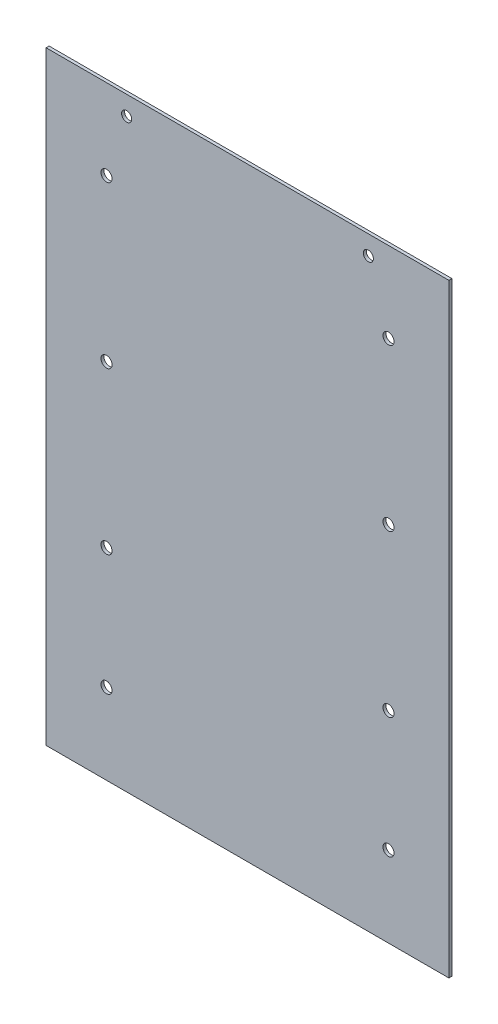
ISO-10303-21;
HEADER;
FILE_DESCRIPTION(('STEP AP214'),'2;1');
FILE_NAME('part.step','',(''),(''),'','','');
FILE_SCHEMA(('AUTOMOTIVE_DESIGN { 1 0 10303 214 1 1 1 1 }'));
ENDSEC;
DATA;
#1=APPLICATION_CONTEXT('core data for automotive mechanical design processes');
#2=APPLICATION_PROTOCOL_DEFINITION('international standard','automotive_design',2000,#1);
#3=PRODUCT_CONTEXT('',#1,'mechanical');
#4=PRODUCT('Part','Part','',(#3));
#5=PRODUCT_RELATED_PRODUCT_CATEGORY('part','',(#4));
#6=PRODUCT_DEFINITION_FORMATION('','',#4);
#7=PRODUCT_DEFINITION_CONTEXT('part definition',#1,'design');
#8=PRODUCT_DEFINITION('design','',#6,#7);
#9=PRODUCT_DEFINITION_SHAPE('','',#8);
#10=(LENGTH_UNIT() NAMED_UNIT(*) SI_UNIT(.MILLI.,.METRE.));
#11=(NAMED_UNIT(*) PLANE_ANGLE_UNIT() SI_UNIT($,.RADIAN.));
#12=(NAMED_UNIT(*) SI_UNIT($,.STERADIAN.) SOLID_ANGLE_UNIT());
#13=UNCERTAINTY_MEASURE_WITH_UNIT(LENGTH_MEASURE(1.E-05),#10,'distance_accuracy_value','');
#14=(GEOMETRIC_REPRESENTATION_CONTEXT(3) GLOBAL_UNCERTAINTY_ASSIGNED_CONTEXT((#13)) GLOBAL_UNIT_ASSIGNED_CONTEXT((#10,
#11,#12)) REPRESENTATION_CONTEXT('',''));
#15=CARTESIAN_POINT('',(0.,0.,0.));
#16=DIRECTION('',(0.,0.,1.));
#17=DIRECTION('',(1.,0.,0.));
#18=AXIS2_PLACEMENT_3D('',#15,#16,#17);
#19=CARTESIAN_POINT('',(170.,100.,-1.5));
#20=DIRECTION('',(0.,0.,1.));
#21=DIRECTION('',(1.,0.,0.));
#22=AXIS2_PLACEMENT_3D('',#19,#20,#21);
#23=CYLINDRICAL_SURFACE('',#22,2.75000000000001);
#24=CARTESIAN_POINT('',(170.,100.,-1.5));
#25=DIRECTION('',(0.,0.,1.));
#26=DIRECTION('',(1.,0.,0.));
#27=AXIS2_PLACEMENT_3D('',#24,#25,#26);
#28=CIRCLE('',#27,2.75000000000001);
#29=CARTESIAN_POINT('',(172.75,100.,-1.5));
#30=VERTEX_POINT('',#29);
#31=EDGE_CURVE('E56',#30,#30,#28,.T.);
#32=ORIENTED_EDGE('',*,*,#31,.F.);
#33=EDGE_LOOP('',(#32));
#34=FACE_BOUND('',#33,.T.);
#35=CARTESIAN_POINT('',(170.,100.,0.));
#36=DIRECTION('',(0.,0.,1.));
#37=DIRECTION('',(1.,0.,0.));
#38=AXIS2_PLACEMENT_3D('',#35,#36,#37);
#39=CIRCLE('',#38,2.75000000000001);
#40=CARTESIAN_POINT('',(172.75,100.,0.));
#41=VERTEX_POINT('',#40);
#42=EDGE_CURVE('E11',#41,#41,#39,.T.);
#43=ORIENTED_EDGE('',*,*,#42,.T.);
#44=EDGE_LOOP('',(#43));
#45=FACE_BOUND('',#44,.T.);
#46=ADVANCED_FACE('F48',(#34,#45),#23,.F.);
#47=CARTESIAN_POINT('',(30.,100.,-1.5));
#48=DIRECTION('',(0.,0.,1.));
#49=DIRECTION('',(1.,0.,0.));
#50=AXIS2_PLACEMENT_3D('',#47,#48,#49);
#51=CYLINDRICAL_SURFACE('',#50,2.75);
#52=CARTESIAN_POINT('',(30.,100.,-1.5));
#53=DIRECTION('',(0.,0.,1.));
#54=DIRECTION('',(1.,0.,0.));
#55=AXIS2_PLACEMENT_3D('',#52,#53,#54);
#56=CIRCLE('',#55,2.75);
#57=CARTESIAN_POINT('',(32.75,100.,-1.5));
#58=VERTEX_POINT('',#57);
#59=EDGE_CURVE('E127',#58,#58,#56,.T.);
#60=ORIENTED_EDGE('',*,*,#59,.F.);
#61=EDGE_LOOP('',(#60));
#62=FACE_BOUND('',#61,.T.);
#63=CARTESIAN_POINT('',(30.,100.,0.));
#64=DIRECTION('',(0.,0.,1.));
#65=DIRECTION('',(1.,0.,0.));
#66=AXIS2_PLACEMENT_3D('',#63,#64,#65);
#67=CIRCLE('',#66,2.75);
#68=CARTESIAN_POINT('',(32.75,100.,0.));
#69=VERTEX_POINT('',#68);
#70=EDGE_CURVE('E132',#69,#69,#67,.T.);
#71=ORIENTED_EDGE('',*,*,#70,.T.);
#72=EDGE_LOOP('',(#71));
#73=FACE_BOUND('',#72,.T.);
#74=ADVANCED_FACE('F140',(#62,#73),#51,.F.);
#75=CARTESIAN_POINT('',(0.,0.,-1.5));
#76=DIRECTION('',(-1.,0.,0.));
#77=DIRECTION('',(0.,0.,1.));
#78=AXIS2_PLACEMENT_3D('',#75,#76,#77);
#79=PLANE('',#78);
#80=DIRECTION('',(0.,-1.,0.));
#81=VECTOR('',#80,1.);
#82=CARTESIAN_POINT('',(0.,0.,0.));
#83=LINE('',#82,#81);
#84=CARTESIAN_POINT('',(0.,300.,0.));
#85=VERTEX_POINT('',#84);
#86=CARTESIAN_POINT('',(0.,0.,0.));
#87=VERTEX_POINT('',#86);
#88=EDGE_CURVE('E117',#85,#87,#83,.T.);
#89=ORIENTED_EDGE('',*,*,#88,.F.);
#90=DIRECTION('',(0.,0.,1.));
#91=VECTOR('',#90,1.);
#92=CARTESIAN_POINT('',(0.,300.,-1.5));
#93=LINE('',#92,#91);
#94=CARTESIAN_POINT('',(0.,300.,-1.5));
#95=VERTEX_POINT('',#94);
#96=EDGE_CURVE('E64',#95,#85,#93,.T.);
#97=ORIENTED_EDGE('',*,*,#96,.F.);
#98=DIRECTION('',(0.,-1.,0.));
#99=VECTOR('',#98,1.);
#100=CARTESIAN_POINT('',(0.,0.,-1.5));
#101=LINE('',#100,#99);
#102=CARTESIAN_POINT('',(0.,0.,-1.5));
#103=VERTEX_POINT('',#102);
#104=EDGE_CURVE('E110',#95,#103,#101,.T.);
#105=ORIENTED_EDGE('',*,*,#104,.T.);
#106=DIRECTION('',(0.,0.,1.));
#107=VECTOR('',#106,1.);
#108=CARTESIAN_POINT('',(0.,0.,-1.5));
#109=LINE('',#108,#107);
#110=EDGE_CURVE('E92',#103,#87,#109,.T.);
#111=ORIENTED_EDGE('',*,*,#110,.T.);
#112=EDGE_LOOP('',(#89,#97,#105,#111));
#113=FACE_BOUND('',#112,.T.);
#114=ADVANCED_FACE('F163',(#113),#79,.T.);
#115=CARTESIAN_POINT('',(0.,300.,-1.5));
#116=DIRECTION('',(0.,1.,0.));
#117=DIRECTION('',(-1.,0.,0.));
#118=AXIS2_PLACEMENT_3D('',#115,#116,#117);
#119=PLANE('',#118);
#120=DIRECTION('',(-1.,0.,0.));
#121=VECTOR('',#120,1.);
#122=CARTESIAN_POINT('',(0.,300.,0.));
#123=LINE('',#122,#121);
#124=CARTESIAN_POINT('',(200.,300.,0.));
#125=VERTEX_POINT('',#124);
#126=EDGE_CURVE('E112',#125,#85,#123,.T.);
#127=ORIENTED_EDGE('',*,*,#126,.F.);
#128=DIRECTION('',(0.,0.,1.));
#129=VECTOR('',#128,1.);
#130=CARTESIAN_POINT('',(200.,300.,-1.5));
#131=LINE('',#130,#129);
#132=CARTESIAN_POINT('',(200.,300.,-1.5));
#133=VERTEX_POINT('',#132);
#134=EDGE_CURVE('E81',#133,#125,#131,.T.);
#135=ORIENTED_EDGE('',*,*,#134,.F.);
#136=DIRECTION('',(-1.,0.,0.));
#137=VECTOR('',#136,1.);
#138=CARTESIAN_POINT('',(0.,300.,-1.5));
#139=LINE('',#138,#137);
#140=EDGE_CURVE('E107',#133,#95,#139,.T.);
#141=ORIENTED_EDGE('',*,*,#140,.T.);
#142=ORIENTED_EDGE('',*,*,#96,.T.);
#143=EDGE_LOOP('',(#127,#135,#141,#142));
#144=FACE_BOUND('',#143,.T.);
#145=ADVANCED_FACE('F160',(#144),#119,.T.);
#146=CARTESIAN_POINT('',(200.,0.,-1.5));
#147=DIRECTION('',(1.,0.,0.));
#148=DIRECTION('',(0.,0.,-1.));
#149=AXIS2_PLACEMENT_3D('',#146,#147,#148);
#150=PLANE('',#149);
#151=DIRECTION('',(0.,1.,0.));
#152=VECTOR('',#151,1.);
#153=CARTESIAN_POINT('',(200.,0.,0.));
#154=LINE('',#153,#152);
#155=CARTESIAN_POINT('',(200.,0.,0.));
#156=VERTEX_POINT('',#155);
#157=EDGE_CURVE('E100',#156,#125,#154,.T.);
#158=ORIENTED_EDGE('',*,*,#157,.F.);
#159=DIRECTION('',(0.,0.,1.));
#160=VECTOR('',#159,1.);
#161=CARTESIAN_POINT('',(200.,0.,-1.5));
#162=LINE('',#161,#160);
#163=CARTESIAN_POINT('',(200.,0.,-1.5));
#164=VERTEX_POINT('',#163);
#165=EDGE_CURVE('E95',#164,#156,#162,.T.);
#166=ORIENTED_EDGE('',*,*,#165,.F.);
#167=DIRECTION('',(0.,1.,0.));
#168=VECTOR('',#167,1.);
#169=CARTESIAN_POINT('',(200.,0.,-1.5));
#170=LINE('',#169,#168);
#171=EDGE_CURVE('E98',#164,#133,#170,.T.);
#172=ORIENTED_EDGE('',*,*,#171,.T.);
#173=ORIENTED_EDGE('',*,*,#134,.T.);
#174=EDGE_LOOP('',(#158,#166,#172,#173));
#175=FACE_BOUND('',#174,.T.);
#176=ADVANCED_FACE('F97',(#175),#150,.T.);
#177=CARTESIAN_POINT('',(0.,0.,-1.5));
#178=DIRECTION('',(0.,-1.,0.));
#179=DIRECTION('',(0.,0.,-1.));
#180=AXIS2_PLACEMENT_3D('',#177,#178,#179);
#181=PLANE('',#180);
#182=DIRECTION('',(1.,0.,0.));
#183=VECTOR('',#182,1.);
#184=CARTESIAN_POINT('',(0.,0.,0.));
#185=LINE('',#184,#183);
#186=EDGE_CURVE('E120',#87,#156,#185,.T.);
#187=ORIENTED_EDGE('',*,*,#186,.F.);
#188=ORIENTED_EDGE('',*,*,#110,.F.);
#189=DIRECTION('',(1.,0.,0.));
#190=VECTOR('',#189,1.);
#191=CARTESIAN_POINT('',(0.,0.,-1.5));
#192=LINE('',#191,#190);
#193=EDGE_CURVE('E106',#103,#164,#192,.T.);
#194=ORIENTED_EDGE('',*,*,#193,.T.);
#195=ORIENTED_EDGE('',*,*,#165,.T.);
#196=EDGE_LOOP('',(#187,#188,#194,#195));
#197=FACE_BOUND('',#196,.T.);
#198=ADVANCED_FACE('F109',(#197),#181,.T.);
#199=CARTESIAN_POINT('',(0.,0.,-1.5));
#200=DIRECTION('',(0.,0.,-1.));
#201=DIRECTION('',(-1.,0.,0.));
#202=AXIS2_PLACEMENT_3D('',#199,#200,#201);
#203=PLANE('',#202);
#204=CARTESIAN_POINT('',(30.,40.0000000000001,-1.5));
#205=DIRECTION('',(0.,0.,1.));
#206=DIRECTION('',(1.,0.,0.));
#207=AXIS2_PLACEMENT_3D('',#204,#205,#206);
#208=CIRCLE('',#207,2.75);
#209=CARTESIAN_POINT('',(32.75,40.0000000000001,-1.5));
#210=VERTEX_POINT('',#209);
#211=EDGE_CURVE('E378',#210,#210,#208,.T.);
#212=ORIENTED_EDGE('',*,*,#211,.T.);
#213=EDGE_LOOP('',(#212));
#214=FACE_BOUND('',#213,.T.);
#215=CARTESIAN_POINT('',(170.,40.0000000000001,-1.5));
#216=DIRECTION('',(0.,0.,1.));
#217=DIRECTION('',(1.,0.,0.));
#218=AXIS2_PLACEMENT_3D('',#215,#216,#217);
#219=CIRCLE('',#218,2.75000000000001);
#220=CARTESIAN_POINT('',(172.75,40.0000000000001,-1.5));
#221=VERTEX_POINT('',#220);
#222=EDGE_CURVE('E382',#221,#221,#219,.T.);
#223=ORIENTED_EDGE('',*,*,#222,.T.);
#224=EDGE_LOOP('',(#223));
#225=FACE_BOUND('',#224,.T.);
#226=CARTESIAN_POINT('',(170.,180.,-1.5));
#227=DIRECTION('',(0.,0.,1.));
#228=DIRECTION('',(1.,0.,0.));
#229=AXIS2_PLACEMENT_3D('',#226,#227,#228);
#230=CIRCLE('',#229,2.75000000000001);
#231=CARTESIAN_POINT('',(172.75,180.,-1.5));
#232=VERTEX_POINT('',#231);
#233=EDGE_CURVE('E373',#232,#232,#230,.T.);
#234=ORIENTED_EDGE('',*,*,#233,.T.);
#235=EDGE_LOOP('',(#234));
#236=FACE_BOUND('',#235,.T.);
#237=CARTESIAN_POINT('',(30.,180.,-1.5));
#238=DIRECTION('',(0.,0.,1.));
#239=DIRECTION('',(1.,0.,0.));
#240=AXIS2_PLACEMENT_3D('',#237,#238,#239);
#241=CIRCLE('',#240,2.75);
#242=CARTESIAN_POINT('',(32.75,180.,-1.5));
#243=VERTEX_POINT('',#242);
#244=EDGE_CURVE('E365',#243,#243,#241,.T.);
#245=ORIENTED_EDGE('',*,*,#244,.T.);
#246=EDGE_LOOP('',(#245));
#247=FACE_BOUND('',#246,.T.);
#248=CARTESIAN_POINT('',(30.,260.,-1.5));
#249=DIRECTION('',(0.,0.,1.));
#250=DIRECTION('',(1.,0.,0.));
#251=AXIS2_PLACEMENT_3D('',#248,#249,#250);
#252=CIRCLE('',#251,2.75);
#253=CARTESIAN_POINT('',(32.75,260.,-1.5));
#254=VERTEX_POINT('',#253);
#255=EDGE_CURVE('E344',#254,#254,#252,.T.);
#256=ORIENTED_EDGE('',*,*,#255,.T.);
#257=EDGE_LOOP('',(#256));
#258=FACE_BOUND('',#257,.T.);
#259=CARTESIAN_POINT('',(170.,260.,-1.5));
#260=DIRECTION('',(0.,0.,1.));
#261=DIRECTION('',(1.,0.,0.));
#262=AXIS2_PLACEMENT_3D('',#259,#260,#261);
#263=CIRCLE('',#262,2.75000000000001);
#264=CARTESIAN_POINT('',(172.75,260.,-1.5));
#265=VERTEX_POINT('',#264);
#266=EDGE_CURVE('E353',#265,#265,#263,.T.);
#267=ORIENTED_EDGE('',*,*,#266,.T.);
#268=EDGE_LOOP('',(#267));
#269=FACE_BOUND('',#268,.T.);
#270=CARTESIAN_POINT('',(40.,290.5,-1.5));
#271=DIRECTION('',(0.,0.,1.));
#272=DIRECTION('',(1.,0.,0.));
#273=AXIS2_PLACEMENT_3D('',#270,#271,#272);
#274=CIRCLE('',#273,2.5);
#275=CARTESIAN_POINT('',(42.5,290.5,-1.5));
#276=VERTEX_POINT('',#275);
#277=EDGE_CURVE('E121',#276,#276,#274,.T.);
#278=ORIENTED_EDGE('',*,*,#277,.T.);
#279=EDGE_LOOP('',(#278));
#280=FACE_BOUND('',#279,.T.);
#281=CARTESIAN_POINT('',(160.,290.5,-1.5));
#282=DIRECTION('',(0.,0.,1.));
#283=DIRECTION('',(1.,0.,0.));
#284=AXIS2_PLACEMENT_3D('',#281,#282,#283);
#285=CIRCLE('',#284,2.5);
#286=CARTESIAN_POINT('',(162.5,290.5,-1.5));
#287=VERTEX_POINT('',#286);
#288=EDGE_CURVE('E336',#287,#287,#285,.T.);
#289=ORIENTED_EDGE('',*,*,#288,.T.);
#290=EDGE_LOOP('',(#289));
#291=FACE_BOUND('',#290,.T.);
#292=ORIENTED_EDGE('',*,*,#104,.F.);
#293=ORIENTED_EDGE('',*,*,#140,.F.);
#294=ORIENTED_EDGE('',*,*,#171,.F.);
#295=ORIENTED_EDGE('',*,*,#193,.F.);
#296=EDGE_LOOP('',(#292,#293,#294,#295));
#297=FACE_BOUND('',#296,.T.);
#298=ORIENTED_EDGE('',*,*,#59,.T.);
#299=EDGE_LOOP('',(#298));
#300=FACE_BOUND('',#299,.T.);
#301=ORIENTED_EDGE('',*,*,#31,.T.);
#302=EDGE_LOOP('',(#301));
#303=FACE_BOUND('',#302,.T.);
#304=ADVANCED_FACE('F104',(#214,#225,#236,#247,#258,#269,#280,#291,#297,#300,#303),#203,.T.);
#305=CARTESIAN_POINT('',(0.,0.,0.));
#306=DIRECTION('',(0.,0.,-1.));
#307=DIRECTION('',(-1.,0.,0.));
#308=AXIS2_PLACEMENT_3D('',#305,#306,#307);
#309=PLANE('',#308);
#310=CARTESIAN_POINT('',(30.,40.0000000000001,0.));
#311=DIRECTION('',(0.,0.,1.));
#312=DIRECTION('',(1.,0.,0.));
#313=AXIS2_PLACEMENT_3D('',#310,#311,#312);
#314=CIRCLE('',#313,2.75);
#315=CARTESIAN_POINT('',(32.75,40.0000000000001,0.));
#316=VERTEX_POINT('',#315);
#317=EDGE_CURVE('E385',#316,#316,#314,.T.);
#318=ORIENTED_EDGE('',*,*,#317,.F.);
#319=EDGE_LOOP('',(#318));
#320=FACE_BOUND('',#319,.T.);
#321=CARTESIAN_POINT('',(170.,40.0000000000001,0.));
#322=DIRECTION('',(0.,0.,1.));
#323=DIRECTION('',(1.,0.,0.));
#324=AXIS2_PLACEMENT_3D('',#321,#322,#323);
#325=CIRCLE('',#324,2.75000000000001);
#326=CARTESIAN_POINT('',(172.75,40.0000000000001,0.));
#327=VERTEX_POINT('',#326);
#328=EDGE_CURVE('E379',#327,#327,#325,.T.);
#329=ORIENTED_EDGE('',*,*,#328,.F.);
#330=EDGE_LOOP('',(#329));
#331=FACE_BOUND('',#330,.T.);
#332=CARTESIAN_POINT('',(170.,180.,0.));
#333=DIRECTION('',(0.,0.,1.));
#334=DIRECTION('',(1.,0.,0.));
#335=AXIS2_PLACEMENT_3D('',#332,#333,#334);
#336=CIRCLE('',#335,2.75000000000001);
#337=CARTESIAN_POINT('',(172.75,180.,0.));
#338=VERTEX_POINT('',#337);
#339=EDGE_CURVE('E369',#338,#338,#336,.T.);
#340=ORIENTED_EDGE('',*,*,#339,.F.);
#341=EDGE_LOOP('',(#340));
#342=FACE_BOUND('',#341,.T.);
#343=CARTESIAN_POINT('',(30.,180.,0.));
#344=DIRECTION('',(0.,0.,1.));
#345=DIRECTION('',(1.,0.,0.));
#346=AXIS2_PLACEMENT_3D('',#343,#344,#345);
#347=CIRCLE('',#346,2.75);
#348=CARTESIAN_POINT('',(32.75,180.,0.));
#349=VERTEX_POINT('',#348);
#350=EDGE_CURVE('E356',#349,#349,#347,.T.);
#351=ORIENTED_EDGE('',*,*,#350,.F.);
#352=EDGE_LOOP('',(#351));
#353=FACE_BOUND('',#352,.T.);
#354=CARTESIAN_POINT('',(30.,260.,0.));
#355=DIRECTION('',(0.,0.,1.));
#356=DIRECTION('',(1.,0.,0.));
#357=AXIS2_PLACEMENT_3D('',#354,#355,#356);
#358=CIRCLE('',#357,2.75);
#359=CARTESIAN_POINT('',(32.75,260.,0.));
#360=VERTEX_POINT('',#359);
#361=EDGE_CURVE('E348',#360,#360,#358,.T.);
#362=ORIENTED_EDGE('',*,*,#361,.F.);
#363=EDGE_LOOP('',(#362));
#364=FACE_BOUND('',#363,.T.);
#365=CARTESIAN_POINT('',(170.,260.,0.));
#366=DIRECTION('',(0.,0.,1.));
#367=DIRECTION('',(1.,0.,0.));
#368=AXIS2_PLACEMENT_3D('',#365,#366,#367);
#369=CIRCLE('',#368,2.75000000000001);
#370=CARTESIAN_POINT('',(172.75,260.,0.));
#371=VERTEX_POINT('',#370);
#372=EDGE_CURVE('E360',#371,#371,#369,.T.);
#373=ORIENTED_EDGE('',*,*,#372,.F.);
#374=EDGE_LOOP('',(#373));
#375=FACE_BOUND('',#374,.T.);
#376=CARTESIAN_POINT('',(40.,290.5,0.));
#377=DIRECTION('',(0.,0.,1.));
#378=DIRECTION('',(1.,0.,0.));
#379=AXIS2_PLACEMENT_3D('',#376,#377,#378);
#380=CIRCLE('',#379,2.5);
#381=CARTESIAN_POINT('',(42.5,290.5,0.));
#382=VERTEX_POINT('',#381);
#383=EDGE_CURVE('E334',#382,#382,#380,.T.);
#384=ORIENTED_EDGE('',*,*,#383,.F.);
#385=EDGE_LOOP('',(#384));
#386=FACE_BOUND('',#385,.T.);
#387=CARTESIAN_POINT('',(160.,290.5,0.));
#388=DIRECTION('',(0.,0.,1.));
#389=DIRECTION('',(1.,0.,0.));
#390=AXIS2_PLACEMENT_3D('',#387,#388,#389);
#391=CIRCLE('',#390,2.5);
#392=CARTESIAN_POINT('',(162.5,290.5,0.));
#393=VERTEX_POINT('',#392);
#394=EDGE_CURVE('E340',#393,#393,#391,.T.);
#395=ORIENTED_EDGE('',*,*,#394,.F.);
#396=EDGE_LOOP('',(#395));
#397=FACE_BOUND('',#396,.T.);
#398=ORIENTED_EDGE('',*,*,#88,.T.);
#399=ORIENTED_EDGE('',*,*,#186,.T.);
#400=ORIENTED_EDGE('',*,*,#157,.T.);
#401=ORIENTED_EDGE('',*,*,#126,.T.);
#402=EDGE_LOOP('',(#398,#399,#400,#401));
#403=FACE_BOUND('',#402,.T.);
#404=ORIENTED_EDGE('',*,*,#70,.F.);
#405=EDGE_LOOP('',(#404));
#406=FACE_BOUND('',#405,.T.);
#407=ORIENTED_EDGE('',*,*,#42,.F.);
#408=EDGE_LOOP('',(#407));
#409=FACE_BOUND('',#408,.T.);
#410=ADVANCED_FACE('F143',(#320,#331,#342,#353,#364,#375,#386,#397,#403,#406,#409),#309,.F.);
#411=CARTESIAN_POINT('',(160.,290.5,-1.5));
#412=DIRECTION('',(0.,0.,1.));
#413=DIRECTION('',(1.,0.,0.));
#414=AXIS2_PLACEMENT_3D('',#411,#412,#413);
#415=CYLINDRICAL_SURFACE('',#414,2.5);
#416=ORIENTED_EDGE('',*,*,#288,.F.);
#417=EDGE_LOOP('',(#416));
#418=FACE_BOUND('',#417,.T.);
#419=ORIENTED_EDGE('',*,*,#394,.T.);
#420=EDGE_LOOP('',(#419));
#421=FACE_BOUND('',#420,.T.);
#422=ADVANCED_FACE('F145',(#418,#421),#415,.F.);
#423=CARTESIAN_POINT('',(40.,290.5,-1.5));
#424=DIRECTION('',(0.,0.,1.));
#425=DIRECTION('',(1.,0.,0.));
#426=AXIS2_PLACEMENT_3D('',#423,#424,#425);
#427=CYLINDRICAL_SURFACE('',#426,2.5);
#428=ORIENTED_EDGE('',*,*,#277,.F.);
#429=EDGE_LOOP('',(#428));
#430=FACE_BOUND('',#429,.T.);
#431=ORIENTED_EDGE('',*,*,#383,.T.);
#432=EDGE_LOOP('',(#431));
#433=FACE_BOUND('',#432,.T.);
#434=ADVANCED_FACE('F152',(#430,#433),#427,.F.);
#435=CARTESIAN_POINT('',(170.,260.,-1.5));
#436=DIRECTION('',(0.,0.,1.));
#437=DIRECTION('',(1.,0.,0.));
#438=AXIS2_PLACEMENT_3D('',#435,#436,#437);
#439=CYLINDRICAL_SURFACE('',#438,2.75000000000001);
#440=ORIENTED_EDGE('',*,*,#266,.F.);
#441=EDGE_LOOP('',(#440));
#442=FACE_BOUND('',#441,.T.);
#443=ORIENTED_EDGE('',*,*,#372,.T.);
#444=EDGE_LOOP('',(#443));
#445=FACE_BOUND('',#444,.T.);
#446=ADVANCED_FACE('F268',(#442,#445),#439,.F.);
#447=CARTESIAN_POINT('',(30.,260.,-1.5));
#448=DIRECTION('',(0.,0.,1.));
#449=DIRECTION('',(1.,0.,0.));
#450=AXIS2_PLACEMENT_3D('',#447,#448,#449);
#451=CYLINDRICAL_SURFACE('',#450,2.75);
#452=ORIENTED_EDGE('',*,*,#255,.F.);
#453=EDGE_LOOP('',(#452));
#454=FACE_BOUND('',#453,.T.);
#455=ORIENTED_EDGE('',*,*,#361,.T.);
#456=EDGE_LOOP('',(#455));
#457=FACE_BOUND('',#456,.T.);
#458=ADVANCED_FACE('F260',(#454,#457),#451,.F.);
#459=CARTESIAN_POINT('',(30.,180.,-1.5));
#460=DIRECTION('',(0.,0.,1.));
#461=DIRECTION('',(1.,0.,0.));
#462=AXIS2_PLACEMENT_3D('',#459,#460,#461);
#463=CYLINDRICAL_SURFACE('',#462,2.75);
#464=ORIENTED_EDGE('',*,*,#244,.F.);
#465=EDGE_LOOP('',(#464));
#466=FACE_BOUND('',#465,.T.);
#467=ORIENTED_EDGE('',*,*,#350,.T.);
#468=EDGE_LOOP('',(#467));
#469=FACE_BOUND('',#468,.T.);
#470=ADVANCED_FACE('F247',(#466,#469),#463,.F.);
#471=CARTESIAN_POINT('',(170.,180.,-1.5));
#472=DIRECTION('',(0.,0.,1.));
#473=DIRECTION('',(1.,0.,0.));
#474=AXIS2_PLACEMENT_3D('',#471,#472,#473);
#475=CYLINDRICAL_SURFACE('',#474,2.75000000000001);
#476=ORIENTED_EDGE('',*,*,#233,.F.);
#477=EDGE_LOOP('',(#476));
#478=FACE_BOUND('',#477,.T.);
#479=ORIENTED_EDGE('',*,*,#339,.T.);
#480=EDGE_LOOP('',(#479));
#481=FACE_BOUND('',#480,.T.);
#482=ADVANCED_FACE('F208',(#478,#481),#475,.F.);
#483=CARTESIAN_POINT('',(170.,40.0000000000001,-1.5));
#484=DIRECTION('',(0.,0.,1.));
#485=DIRECTION('',(1.,0.,0.));
#486=AXIS2_PLACEMENT_3D('',#483,#484,#485);
#487=CYLINDRICAL_SURFACE('',#486,2.75000000000001);
#488=ORIENTED_EDGE('',*,*,#222,.F.);
#489=EDGE_LOOP('',(#488));
#490=FACE_BOUND('',#489,.T.);
#491=ORIENTED_EDGE('',*,*,#328,.T.);
#492=EDGE_LOOP('',(#491));
#493=FACE_BOUND('',#492,.T.);
#494=ADVANCED_FACE('F215',(#490,#493),#487,.F.);
#495=CARTESIAN_POINT('',(30.,40.0000000000001,-1.5));
#496=DIRECTION('',(0.,0.,1.));
#497=DIRECTION('',(1.,0.,0.));
#498=AXIS2_PLACEMENT_3D('',#495,#496,#497);
#499=CYLINDRICAL_SURFACE('',#498,2.75);
#500=ORIENTED_EDGE('',*,*,#211,.F.);
#501=EDGE_LOOP('',(#500));
#502=FACE_BOUND('',#501,.T.);
#503=ORIENTED_EDGE('',*,*,#317,.T.);
#504=EDGE_LOOP('',(#503));
#505=FACE_BOUND('',#504,.T.);
#506=ADVANCED_FACE('F220',(#502,#505),#499,.F.);
#507=CLOSED_SHELL('',(#46,#74,#114,#145,#176,#198,#304,#410,#422,#434,#446,#458,#470,#482,#494,#506));
#508=MANIFOLD_SOLID_BREP('B2',#507);
#509=ADVANCED_BREP_SHAPE_REPRESENTATION('',(#18,#508),#14);
#510=SHAPE_DEFINITION_REPRESENTATION(#9,#509);
ENDSEC;
END-ISO-10303-21;
